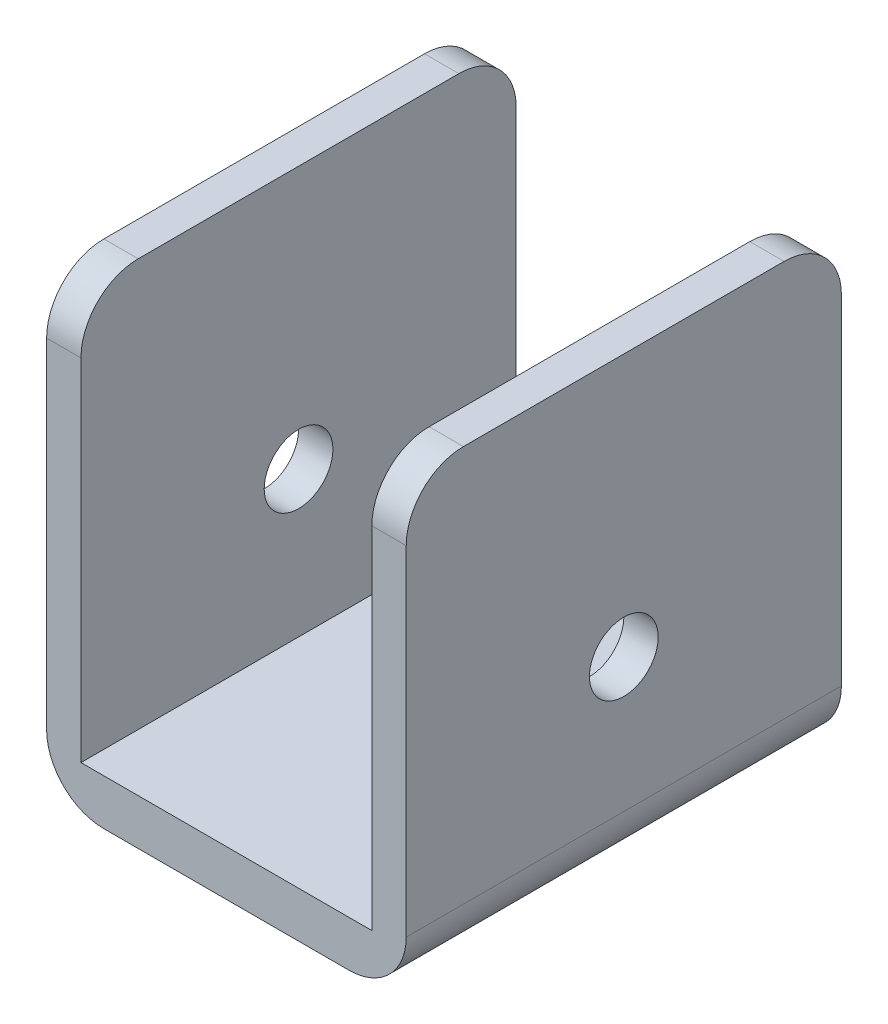
ISO-10303-21;
HEADER;
FILE_DESCRIPTION(('STEP AP214'),'2;1');
FILE_NAME('part.step','',(''),(''),'','','');
FILE_SCHEMA(('AUTOMOTIVE_DESIGN { 1 0 10303 214 1 1 1 1 }'));
ENDSEC;
DATA;
#1=APPLICATION_CONTEXT('core data for automotive mechanical design processes');
#2=APPLICATION_PROTOCOL_DEFINITION('international standard','automotive_design',2000,#1);
#3=PRODUCT_CONTEXT('',#1,'mechanical');
#4=PRODUCT('Part','Part','',(#3));
#5=PRODUCT_RELATED_PRODUCT_CATEGORY('part','',(#4));
#6=PRODUCT_DEFINITION_FORMATION('','',#4);
#7=PRODUCT_DEFINITION_CONTEXT('part definition',#1,'design');
#8=PRODUCT_DEFINITION('design','',#6,#7);
#9=PRODUCT_DEFINITION_SHAPE('','',#8);
#10=(LENGTH_UNIT() NAMED_UNIT(*) SI_UNIT(.MILLI.,.METRE.));
#11=(NAMED_UNIT(*) PLANE_ANGLE_UNIT() SI_UNIT($,.RADIAN.));
#12=(NAMED_UNIT(*) SI_UNIT($,.STERADIAN.) SOLID_ANGLE_UNIT());
#13=UNCERTAINTY_MEASURE_WITH_UNIT(LENGTH_MEASURE(1.E-05),#10,'distance_accuracy_value','');
#14=(GEOMETRIC_REPRESENTATION_CONTEXT(3) GLOBAL_UNCERTAINTY_ASSIGNED_CONTEXT((#13)) GLOBAL_UNIT_ASSIGNED_CONTEXT((#10,
#11,#12)) REPRESENTATION_CONTEXT('',''));
#15=CARTESIAN_POINT('',(0.,0.,0.));
#16=DIRECTION('',(0.,0.,1.));
#17=DIRECTION('',(1.,0.,0.));
#18=AXIS2_PLACEMENT_3D('',#15,#16,#17);
#19=CARTESIAN_POINT('',(-15.7,39.6,19.));
#20=DIRECTION('',(1.,0.,0.));
#21=DIRECTION('',(0.,1.,0.));
#22=AXIS2_PLACEMENT_3D('',#19,#20,#21);
#23=PLANE('',#22);
#24=CARTESIAN_POINT('',(-15.7,16.7,0.));
#25=DIRECTION('',(1.,0.,0.));
#26=DIRECTION('',(0.,1.,0.));
#27=AXIS2_PLACEMENT_3D('',#24,#25,#26);
#28=CIRCLE('',#27,3.);
#29=CARTESIAN_POINT('',(-15.7,19.7,0.));
#30=VERTEX_POINT('',#29);
#31=EDGE_CURVE('E203',#30,#30,#28,.T.);
#32=ORIENTED_EDGE('',*,*,#31,.T.);
#33=EDGE_LOOP('',(#32));
#34=FACE_BOUND('',#33,.T.);
#35=DIRECTION('',(0.,-1.,0.));
#36=VECTOR('',#35,1.);
#37=CARTESIAN_POINT('',(-15.7,39.6,-19.));
#38=LINE('',#37,#36);
#39=CARTESIAN_POINT('',(-15.7,34.6,-19.));
#40=VERTEX_POINT('',#39);
#41=CARTESIAN_POINT('',(-15.7,5.00000000000001,-19.));
#42=VERTEX_POINT('',#41);
#43=EDGE_CURVE('E172',#40,#42,#38,.T.);
#44=ORIENTED_EDGE('',*,*,#43,.T.);
#45=DIRECTION('',(0.,0.,-1.));
#46=VECTOR('',#45,1.);
#47=CARTESIAN_POINT('',(-15.7,5.,19.));
#48=LINE('',#47,#46);
#49=CARTESIAN_POINT('',(-15.7,5.00000000000001,19.));
#50=VERTEX_POINT('',#49);
#51=EDGE_CURVE('E220',#42,#50,#48,.F.);
#52=ORIENTED_EDGE('',*,*,#51,.T.);
#53=DIRECTION('',(0.,-1.,0.));
#54=VECTOR('',#53,1.);
#55=CARTESIAN_POINT('',(-15.7,39.6,19.));
#56=LINE('',#55,#54);
#57=CARTESIAN_POINT('',(-15.7,34.6,19.));
#58=VERTEX_POINT('',#57);
#59=EDGE_CURVE('E188',#58,#50,#56,.T.);
#60=ORIENTED_EDGE('',*,*,#59,.F.);
#61=CARTESIAN_POINT('',(-15.7,34.6,14.));
#62=DIRECTION('',(1.,0.,0.));
#63=DIRECTION('',(0.,1.,0.));
#64=AXIS2_PLACEMENT_3D('',#61,#62,#63);
#65=CIRCLE('',#64,5.);
#66=CARTESIAN_POINT('',(-15.7,39.6,14.));
#67=VERTEX_POINT('',#66);
#68=EDGE_CURVE('E218',#58,#67,#65,.F.);
#69=ORIENTED_EDGE('',*,*,#68,.T.);
#70=DIRECTION('',(0.,0.,-1.));
#71=VECTOR('',#70,1.);
#72=CARTESIAN_POINT('',(-15.7,39.6,19.));
#73=LINE('',#72,#71);
#74=CARTESIAN_POINT('',(-15.7,39.6,-14.));
#75=VERTEX_POINT('',#74);
#76=EDGE_CURVE('E168',#67,#75,#73,.T.);
#77=ORIENTED_EDGE('',*,*,#76,.T.);
#78=CARTESIAN_POINT('',(-15.7,34.6,-14.));
#79=DIRECTION('',(1.,0.,0.));
#80=DIRECTION('',(0.,1.,0.));
#81=AXIS2_PLACEMENT_3D('',#78,#79,#80);
#82=CIRCLE('',#81,5.);
#83=EDGE_CURVE('E216',#75,#40,#82,.F.);
#84=ORIENTED_EDGE('',*,*,#83,.T.);
#85=EDGE_LOOP('',(#44,#52,#60,#69,#77,#84));
#86=FACE_BOUND('',#85,.T.);
#87=ADVANCED_FACE('F41',(#34,#86),#23,.F.);
#88=CARTESIAN_POINT('',(-15.7,0.,19.));
#89=DIRECTION('',(0.,1.,0.));
#90=DIRECTION('',(-1.,0.,0.));
#91=AXIS2_PLACEMENT_3D('',#88,#89,#90);
#92=PLANE('',#91);
#93=DIRECTION('',(1.,0.,0.));
#94=VECTOR('',#93,1.);
#95=CARTESIAN_POINT('',(-15.7,0.,19.));
#96=LINE('',#95,#94);
#97=CARTESIAN_POINT('',(-10.7,0.,19.));
#98=VERTEX_POINT('',#97);
#99=CARTESIAN_POINT('',(10.7,0.,19.));
#100=VERTEX_POINT('',#99);
#101=EDGE_CURVE('E274',#98,#100,#96,.T.);
#102=ORIENTED_EDGE('',*,*,#101,.F.);
#103=DIRECTION('',(0.,0.,-1.));
#104=VECTOR('',#103,1.);
#105=CARTESIAN_POINT('',(-10.7,0.,19.));
#106=LINE('',#105,#104);
#107=CARTESIAN_POINT('',(-10.7,0.,-19.));
#108=VERTEX_POINT('',#107);
#109=EDGE_CURVE('E205',#98,#108,#106,.T.);
#110=ORIENTED_EDGE('',*,*,#109,.T.);
#111=DIRECTION('',(1.,0.,0.));
#112=VECTOR('',#111,1.);
#113=CARTESIAN_POINT('',(-15.7,0.,-19.));
#114=LINE('',#113,#112);
#115=CARTESIAN_POINT('',(10.7,0.,-19.));
#116=VERTEX_POINT('',#115);
#117=EDGE_CURVE('E175',#108,#116,#114,.T.);
#118=ORIENTED_EDGE('',*,*,#117,.T.);
#119=DIRECTION('',(0.,0.,-1.));
#120=VECTOR('',#119,1.);
#121=CARTESIAN_POINT('',(10.7,0.,19.));
#122=LINE('',#121,#120);
#123=EDGE_CURVE('E199',#116,#100,#122,.F.);
#124=ORIENTED_EDGE('',*,*,#123,.T.);
#125=EDGE_LOOP('',(#102,#110,#118,#124));
#126=FACE_BOUND('',#125,.T.);
#127=ADVANCED_FACE('F269',(#126),#92,.F.);
#128=CARTESIAN_POINT('',(15.7,39.6,19.));
#129=DIRECTION('',(-1.,0.,0.));
#130=DIRECTION('',(0.,0.,1.));
#131=AXIS2_PLACEMENT_3D('',#128,#129,#130);
#132=PLANE('',#131);
#133=CARTESIAN_POINT('',(15.7,16.7,0.));
#134=DIRECTION('',(1.,0.,0.));
#135=DIRECTION('',(0.,1.,0.));
#136=AXIS2_PLACEMENT_3D('',#133,#134,#135);
#137=CIRCLE('',#136,3.);
#138=CARTESIAN_POINT('',(15.7,19.7,0.));
#139=VERTEX_POINT('',#138);
#140=EDGE_CURVE('E280',#139,#139,#137,.T.);
#141=ORIENTED_EDGE('',*,*,#140,.F.);
#142=EDGE_LOOP('',(#141));
#143=FACE_BOUND('',#142,.T.);
#144=DIRECTION('',(0.,1.,0.));
#145=VECTOR('',#144,1.);
#146=CARTESIAN_POINT('',(15.7,39.6,19.));
#147=LINE('',#146,#145);
#148=CARTESIAN_POINT('',(15.7,5.00000000000001,19.));
#149=VERTEX_POINT('',#148);
#150=CARTESIAN_POINT('',(15.7,34.6,19.));
#151=VERTEX_POINT('',#150);
#152=EDGE_CURVE('E151',#149,#151,#147,.T.);
#153=ORIENTED_EDGE('',*,*,#152,.F.);
#154=DIRECTION('',(0.,0.,-1.));
#155=VECTOR('',#154,1.);
#156=CARTESIAN_POINT('',(15.7,5.,19.));
#157=LINE('',#156,#155);
#158=CARTESIAN_POINT('',(15.7,5.00000000000001,-19.));
#159=VERTEX_POINT('',#158);
#160=EDGE_CURVE('E234',#149,#159,#157,.T.);
#161=ORIENTED_EDGE('',*,*,#160,.T.);
#162=DIRECTION('',(0.,1.,0.));
#163=VECTOR('',#162,1.);
#164=CARTESIAN_POINT('',(15.7,39.6,-19.));
#165=LINE('',#164,#163);
#166=CARTESIAN_POINT('',(15.7,34.6,-19.));
#167=VERTEX_POINT('',#166);
#168=EDGE_CURVE('E179',#159,#167,#165,.T.);
#169=ORIENTED_EDGE('',*,*,#168,.T.);
#170=CARTESIAN_POINT('',(15.7,34.6,-14.));
#171=DIRECTION('',(-1.,0.,0.));
#172=DIRECTION('',(0.,0.,1.));
#173=AXIS2_PLACEMENT_3D('',#170,#171,#172);
#174=CIRCLE('',#173,5.);
#175=CARTESIAN_POINT('',(15.7,39.6,-14.));
#176=VERTEX_POINT('',#175);
#177=EDGE_CURVE('E232',#167,#176,#174,.F.);
#178=ORIENTED_EDGE('',*,*,#177,.T.);
#179=DIRECTION('',(0.,0.,-1.));
#180=VECTOR('',#179,1.);
#181=CARTESIAN_POINT('',(15.7,39.6,19.));
#182=LINE('',#181,#180);
#183=CARTESIAN_POINT('',(15.7,39.6,14.));
#184=VERTEX_POINT('',#183);
#185=EDGE_CURVE('E196',#184,#176,#182,.T.);
#186=ORIENTED_EDGE('',*,*,#185,.F.);
#187=CARTESIAN_POINT('',(15.7,34.6,14.));
#188=DIRECTION('',(-1.,0.,0.));
#189=DIRECTION('',(0.,0.,1.));
#190=AXIS2_PLACEMENT_3D('',#187,#188,#189);
#191=CIRCLE('',#190,5.);
#192=EDGE_CURVE('E230',#184,#151,#191,.F.);
#193=ORIENTED_EDGE('',*,*,#192,.T.);
#194=EDGE_LOOP('',(#153,#161,#169,#178,#186,#193));
#195=FACE_BOUND('',#194,.T.);
#196=ADVANCED_FACE('F262',(#143,#195),#132,.F.);
#197=CARTESIAN_POINT('',(15.7,39.6,19.));
#198=DIRECTION('',(0.,-1.,0.));
#199=DIRECTION('',(1.,0.,0.));
#200=AXIS2_PLACEMENT_3D('',#197,#198,#199);
#201=PLANE('',#200);
#202=ORIENTED_EDGE('',*,*,#185,.T.);
#203=DIRECTION('',(-1.,0.,0.));
#204=VECTOR('',#203,1.);
#205=CARTESIAN_POINT('',(15.7,39.6,-14.));
#206=LINE('',#205,#204);
#207=CARTESIAN_POINT('',(12.7,39.6,-14.));
#208=VERTEX_POINT('',#207);
#209=EDGE_CURVE('E248',#176,#208,#206,.T.);
#210=ORIENTED_EDGE('',*,*,#209,.T.);
#211=DIRECTION('',(0.,0.,-1.));
#212=VECTOR('',#211,1.);
#213=CARTESIAN_POINT('',(12.7,39.6,19.));
#214=LINE('',#213,#212);
#215=CARTESIAN_POINT('',(12.7,39.6,14.));
#216=VERTEX_POINT('',#215);
#217=EDGE_CURVE('E160',#216,#208,#214,.T.);
#218=ORIENTED_EDGE('',*,*,#217,.F.);
#219=DIRECTION('',(-1.,0.,0.));
#220=VECTOR('',#219,1.);
#221=CARTESIAN_POINT('',(15.7,39.6,14.));
#222=LINE('',#221,#220);
#223=EDGE_CURVE('E246',#216,#184,#222,.F.);
#224=ORIENTED_EDGE('',*,*,#223,.T.);
#225=EDGE_LOOP('',(#202,#210,#218,#224));
#226=FACE_BOUND('',#225,.T.);
#227=ADVANCED_FACE('F250',(#226),#201,.F.);
#228=CARTESIAN_POINT('',(12.7,39.6,19.));
#229=DIRECTION('',(1.,0.,0.));
#230=DIRECTION('',(0.,1.,0.));
#231=AXIS2_PLACEMENT_3D('',#228,#229,#230);
#232=PLANE('',#231);
#233=CARTESIAN_POINT('',(12.7,16.7,0.));
#234=DIRECTION('',(1.,0.,0.));
#235=DIRECTION('',(0.,1.,0.));
#236=AXIS2_PLACEMENT_3D('',#233,#234,#235);
#237=CIRCLE('',#236,3.);
#238=CARTESIAN_POINT('',(12.7,19.7,0.));
#239=VERTEX_POINT('',#238);
#240=EDGE_CURVE('E176',#239,#239,#237,.T.);
#241=ORIENTED_EDGE('',*,*,#240,.T.);
#242=EDGE_LOOP('',(#241));
#243=FACE_BOUND('',#242,.T.);
#244=ORIENTED_EDGE('',*,*,#217,.T.);
#245=CARTESIAN_POINT('',(12.7,34.6,-14.));
#246=DIRECTION('',(1.,0.,0.));
#247=DIRECTION('',(0.,1.,0.));
#248=AXIS2_PLACEMENT_3D('',#245,#246,#247);
#249=CIRCLE('',#248,5.);
#250=CARTESIAN_POINT('',(12.7,34.6,-19.));
#251=VERTEX_POINT('',#250);
#252=EDGE_CURVE('E11',#208,#251,#249,.F.);
#253=ORIENTED_EDGE('',*,*,#252,.T.);
#254=DIRECTION('',(0.,-1.,0.));
#255=VECTOR('',#254,1.);
#256=CARTESIAN_POINT('',(12.7,39.6,-19.));
#257=LINE('',#256,#255);
#258=CARTESIAN_POINT('',(12.7,4.,-19.));
#259=VERTEX_POINT('',#258);
#260=EDGE_CURVE('E157',#251,#259,#257,.T.);
#261=ORIENTED_EDGE('',*,*,#260,.T.);
#262=DIRECTION('',(0.,0.,-1.));
#263=VECTOR('',#262,1.);
#264=CARTESIAN_POINT('',(12.7,4.,19.));
#265=LINE('',#264,#263);
#266=CARTESIAN_POINT('',(12.7,4.,19.));
#267=VERTEX_POINT('',#266);
#268=EDGE_CURVE('E154',#267,#259,#265,.T.);
#269=ORIENTED_EDGE('',*,*,#268,.F.);
#270=DIRECTION('',(0.,-1.,0.));
#271=VECTOR('',#270,1.);
#272=CARTESIAN_POINT('',(12.7,39.6,19.));
#273=LINE('',#272,#271);
#274=CARTESIAN_POINT('',(12.7,34.6,19.));
#275=VERTEX_POINT('',#274);
#276=EDGE_CURVE('E140',#275,#267,#273,.T.);
#277=ORIENTED_EDGE('',*,*,#276,.F.);
#278=CARTESIAN_POINT('',(12.7,34.6,14.));
#279=DIRECTION('',(1.,0.,0.));
#280=DIRECTION('',(0.,1.,0.));
#281=AXIS2_PLACEMENT_3D('',#278,#279,#280);
#282=CIRCLE('',#281,5.);
#283=EDGE_CURVE('E49',#275,#216,#282,.F.);
#284=ORIENTED_EDGE('',*,*,#283,.T.);
#285=EDGE_LOOP('',(#244,#253,#261,#269,#277,#284));
#286=FACE_BOUND('',#285,.T.);
#287=ADVANCED_FACE('F155',(#243,#286),#232,.F.);
#288=CARTESIAN_POINT('',(-12.7,4.,19.));
#289=DIRECTION('',(0.,-1.,0.));
#290=DIRECTION('',(1.,0.,0.));
#291=AXIS2_PLACEMENT_3D('',#288,#289,#290);
#292=PLANE('',#291);
#293=DIRECTION('',(-1.,0.,0.));
#294=VECTOR('',#293,1.);
#295=CARTESIAN_POINT('',(-12.7,4.,-19.));
#296=LINE('',#295,#294);
#297=CARTESIAN_POINT('',(-12.7,4.,-19.));
#298=VERTEX_POINT('',#297);
#299=EDGE_CURVE('E183',#259,#298,#296,.T.);
#300=ORIENTED_EDGE('',*,*,#299,.T.);
#301=DIRECTION('',(0.,0.,-1.));
#302=VECTOR('',#301,1.);
#303=CARTESIAN_POINT('',(-12.7,4.,19.));
#304=LINE('',#303,#302);
#305=CARTESIAN_POINT('',(-12.7,4.,19.));
#306=VERTEX_POINT('',#305);
#307=EDGE_CURVE('E161',#306,#298,#304,.T.);
#308=ORIENTED_EDGE('',*,*,#307,.F.);
#309=DIRECTION('',(-1.,0.,0.));
#310=VECTOR('',#309,1.);
#311=CARTESIAN_POINT('',(-12.7,4.,19.));
#312=LINE('',#311,#310);
#313=EDGE_CURVE('E146',#267,#306,#312,.T.);
#314=ORIENTED_EDGE('',*,*,#313,.F.);
#315=ORIENTED_EDGE('',*,*,#268,.T.);
#316=EDGE_LOOP('',(#300,#308,#314,#315));
#317=FACE_BOUND('',#316,.T.);
#318=ADVANCED_FACE('F163',(#317),#292,.F.);
#319=CARTESIAN_POINT('',(-12.7,39.6,19.));
#320=DIRECTION('',(-1.,0.,0.));
#321=DIRECTION('',(0.,-1.,0.));
#322=AXIS2_PLACEMENT_3D('',#319,#320,#321);
#323=PLANE('',#322);
#324=CARTESIAN_POINT('',(-12.7,16.7,0.));
#325=DIRECTION('',(-1.,0.,0.));
#326=DIRECTION('',(0.,-1.,0.));
#327=AXIS2_PLACEMENT_3D('',#324,#325,#326);
#328=CIRCLE('',#327,3.);
#329=CARTESIAN_POINT('',(-12.7,13.7,0.));
#330=VERTEX_POINT('',#329);
#331=EDGE_CURVE('E200',#330,#330,#328,.T.);
#332=ORIENTED_EDGE('',*,*,#331,.T.);
#333=EDGE_LOOP('',(#332));
#334=FACE_BOUND('',#333,.T.);
#335=DIRECTION('',(0.,0.,-1.));
#336=VECTOR('',#335,1.);
#337=CARTESIAN_POINT('',(-12.7,39.6,19.));
#338=LINE('',#337,#336);
#339=CARTESIAN_POINT('',(-12.7,39.6,14.));
#340=VERTEX_POINT('',#339);
#341=CARTESIAN_POINT('',(-12.7,39.6,-14.));
#342=VERTEX_POINT('',#341);
#343=EDGE_CURVE('E191',#340,#342,#338,.T.);
#344=ORIENTED_EDGE('',*,*,#343,.F.);
#345=CARTESIAN_POINT('',(-12.7,34.6,14.));
#346=DIRECTION('',(-1.,0.,0.));
#347=DIRECTION('',(0.,-1.,0.));
#348=AXIS2_PLACEMENT_3D('',#345,#346,#347);
#349=CIRCLE('',#348,5.);
#350=CARTESIAN_POINT('',(-12.7,34.6,19.));
#351=VERTEX_POINT('',#350);
#352=EDGE_CURVE('E244',#340,#351,#349,.F.);
#353=ORIENTED_EDGE('',*,*,#352,.T.);
#354=DIRECTION('',(0.,1.,0.));
#355=VECTOR('',#354,1.);
#356=CARTESIAN_POINT('',(-12.7,39.6,19.));
#357=LINE('',#356,#355);
#358=EDGE_CURVE('E166',#306,#351,#357,.T.);
#359=ORIENTED_EDGE('',*,*,#358,.F.);
#360=ORIENTED_EDGE('',*,*,#307,.T.);
#361=DIRECTION('',(0.,1.,0.));
#362=VECTOR('',#361,1.);
#363=CARTESIAN_POINT('',(-12.7,39.6,-19.));
#364=LINE('',#363,#362);
#365=CARTESIAN_POINT('',(-12.7,34.6,-19.));
#366=VERTEX_POINT('',#365);
#367=EDGE_CURVE('E185',#298,#366,#364,.T.);
#368=ORIENTED_EDGE('',*,*,#367,.T.);
#369=CARTESIAN_POINT('',(-12.7,34.6,-14.));
#370=DIRECTION('',(-1.,0.,0.));
#371=DIRECTION('',(0.,-1.,0.));
#372=AXIS2_PLACEMENT_3D('',#369,#370,#371);
#373=CIRCLE('',#372,5.);
#374=EDGE_CURVE('E242',#366,#342,#373,.F.);
#375=ORIENTED_EDGE('',*,*,#374,.T.);
#376=EDGE_LOOP('',(#344,#353,#359,#360,#368,#375));
#377=FACE_BOUND('',#376,.T.);
#378=ADVANCED_FACE('F295',(#334,#377),#323,.F.);
#379=CARTESIAN_POINT('',(-15.7,39.6,19.));
#380=DIRECTION('',(0.,-1.,0.));
#381=DIRECTION('',(0.,0.,-1.));
#382=AXIS2_PLACEMENT_3D('',#379,#380,#381);
#383=PLANE('',#382);
#384=ORIENTED_EDGE('',*,*,#76,.F.);
#385=DIRECTION('',(-1.,0.,0.));
#386=VECTOR('',#385,1.);
#387=CARTESIAN_POINT('',(-12.7,39.6,14.));
#388=LINE('',#387,#386);
#389=EDGE_CURVE('E240',#67,#340,#388,.F.);
#390=ORIENTED_EDGE('',*,*,#389,.T.);
#391=ORIENTED_EDGE('',*,*,#343,.T.);
#392=DIRECTION('',(-1.,0.,0.));
#393=VECTOR('',#392,1.);
#394=CARTESIAN_POINT('',(-15.7,39.6,-14.));
#395=LINE('',#394,#393);
#396=EDGE_CURVE('E237',#342,#75,#395,.T.);
#397=ORIENTED_EDGE('',*,*,#396,.T.);
#398=EDGE_LOOP('',(#384,#390,#391,#397));
#399=FACE_BOUND('',#398,.T.);
#400=ADVANCED_FACE('F298',(#399),#383,.F.);
#401=CARTESIAN_POINT('',(0.,0.,19.));
#402=DIRECTION('',(0.,0.,1.));
#403=DIRECTION('',(1.,0.,0.));
#404=AXIS2_PLACEMENT_3D('',#401,#402,#403);
#405=PLANE('',#404);
#406=ORIENTED_EDGE('',*,*,#59,.T.);
#407=CARTESIAN_POINT('',(-10.7,5.,19.));
#408=DIRECTION('',(0.,0.,1.));
#409=DIRECTION('',(1.,0.,0.));
#410=AXIS2_PLACEMENT_3D('',#407,#408,#409);
#411=CIRCLE('',#410,5.);
#412=EDGE_CURVE('E228',#50,#98,#411,.T.);
#413=ORIENTED_EDGE('',*,*,#412,.T.);
#414=ORIENTED_EDGE('',*,*,#101,.T.);
#415=CARTESIAN_POINT('',(10.7,5.,19.));
#416=DIRECTION('',(0.,0.,1.));
#417=DIRECTION('',(1.,0.,0.));
#418=AXIS2_PLACEMENT_3D('',#415,#416,#417);
#419=CIRCLE('',#418,5.);
#420=EDGE_CURVE('E226',#100,#149,#419,.T.);
#421=ORIENTED_EDGE('',*,*,#420,.T.);
#422=ORIENTED_EDGE('',*,*,#152,.T.);
#423=DIRECTION('',(-1.,0.,0.));
#424=VECTOR('',#423,1.);
#425=CARTESIAN_POINT('',(12.7,34.6,19.));
#426=LINE('',#425,#424);
#427=EDGE_CURVE('E150',#151,#275,#426,.T.);
#428=ORIENTED_EDGE('',*,*,#427,.T.);
#429=ORIENTED_EDGE('',*,*,#276,.T.);
#430=ORIENTED_EDGE('',*,*,#313,.T.);
#431=ORIENTED_EDGE('',*,*,#358,.T.);
#432=DIRECTION('',(-1.,0.,0.));
#433=VECTOR('',#432,1.);
#434=CARTESIAN_POINT('',(-15.7,34.6,19.));
#435=LINE('',#434,#433);
#436=EDGE_CURVE('E223',#351,#58,#435,.T.);
#437=ORIENTED_EDGE('',*,*,#436,.T.);
#438=EDGE_LOOP('',(#406,#413,#414,#421,#422,#428,#429,#430,#431,#437));
#439=FACE_BOUND('',#438,.T.);
#440=ADVANCED_FACE('F143',(#439),#405,.T.);
#441=CARTESIAN_POINT('',(0.,0.,-19.));
#442=DIRECTION('',(0.,0.,1.));
#443=DIRECTION('',(1.,0.,0.));
#444=AXIS2_PLACEMENT_3D('',#441,#442,#443);
#445=PLANE('',#444);
#446=ORIENTED_EDGE('',*,*,#117,.F.);
#447=CARTESIAN_POINT('',(-10.7,5.,-19.));
#448=DIRECTION('',(0.,0.,1.));
#449=DIRECTION('',(1.,0.,0.));
#450=AXIS2_PLACEMENT_3D('',#447,#448,#449);
#451=CIRCLE('',#450,5.);
#452=EDGE_CURVE('E214',#108,#42,#451,.F.);
#453=ORIENTED_EDGE('',*,*,#452,.T.);
#454=ORIENTED_EDGE('',*,*,#43,.F.);
#455=DIRECTION('',(-1.,0.,0.));
#456=VECTOR('',#455,1.);
#457=CARTESIAN_POINT('',(0.,34.6,-19.));
#458=LINE('',#457,#456);
#459=EDGE_CURVE('E210',#40,#366,#458,.F.);
#460=ORIENTED_EDGE('',*,*,#459,.T.);
#461=ORIENTED_EDGE('',*,*,#367,.F.);
#462=ORIENTED_EDGE('',*,*,#299,.F.);
#463=ORIENTED_EDGE('',*,*,#260,.F.);
#464=DIRECTION('',(-1.,0.,0.));
#465=VECTOR('',#464,1.);
#466=CARTESIAN_POINT('',(0.,34.6,-19.));
#467=LINE('',#466,#465);
#468=EDGE_CURVE('E208',#251,#167,#467,.F.);
#469=ORIENTED_EDGE('',*,*,#468,.T.);
#470=ORIENTED_EDGE('',*,*,#168,.F.);
#471=CARTESIAN_POINT('',(10.7,5.,-19.));
#472=DIRECTION('',(0.,0.,1.));
#473=DIRECTION('',(1.,0.,0.));
#474=AXIS2_PLACEMENT_3D('',#471,#472,#473);
#475=CIRCLE('',#474,5.);
#476=EDGE_CURVE('E212',#159,#116,#475,.F.);
#477=ORIENTED_EDGE('',*,*,#476,.T.);
#478=EDGE_LOOP('',(#446,#453,#454,#460,#461,#462,#463,#469,#470,#477));
#479=FACE_BOUND('',#478,.T.);
#480=ADVANCED_FACE('F256',(#479),#445,.F.);
#481=CARTESIAN_POINT('',(-15.7,16.7,0.));
#482=DIRECTION('',(1.,0.,0.));
#483=DIRECTION('',(0.,1.,0.));
#484=AXIS2_PLACEMENT_3D('',#481,#482,#483);
#485=CYLINDRICAL_SURFACE('',#484,3.);
#486=ORIENTED_EDGE('',*,*,#31,.F.);
#487=EDGE_LOOP('',(#486));
#488=FACE_BOUND('',#487,.T.);
#489=ORIENTED_EDGE('',*,*,#331,.F.);
#490=EDGE_LOOP('',(#489));
#491=FACE_BOUND('',#490,.T.);
#492=ADVANCED_FACE('F288',(#488,#491),#485,.F.);
#493=ORIENTED_EDGE('',*,*,#140,.T.);
#494=EDGE_LOOP('',(#493));
#495=FACE_BOUND('',#494,.T.);
#496=ORIENTED_EDGE('',*,*,#240,.F.);
#497=EDGE_LOOP('',(#496));
#498=FACE_BOUND('',#497,.T.);
#499=ADVANCED_FACE('F291',(#495,#498),#485,.F.);
#500=CARTESIAN_POINT('',(-10.7,5.,19.));
#501=DIRECTION('',(0.,0.,-1.));
#502=DIRECTION('',(-1.,0.,0.));
#503=AXIS2_PLACEMENT_3D('',#500,#501,#502);
#504=CYLINDRICAL_SURFACE('',#503,5.);
#505=ORIENTED_EDGE('',*,*,#412,.F.);
#506=ORIENTED_EDGE('',*,*,#51,.F.);
#507=ORIENTED_EDGE('',*,*,#452,.F.);
#508=ORIENTED_EDGE('',*,*,#109,.F.);
#509=EDGE_LOOP('',(#505,#506,#507,#508));
#510=FACE_BOUND('',#509,.T.);
#511=ADVANCED_FACE('F315',(#510),#504,.T.);
#512=CARTESIAN_POINT('',(10.7,5.,19.));
#513=DIRECTION('',(0.,0.,-1.));
#514=DIRECTION('',(-1.,0.,0.));
#515=AXIS2_PLACEMENT_3D('',#512,#513,#514);
#516=CYLINDRICAL_SURFACE('',#515,5.);
#517=ORIENTED_EDGE('',*,*,#420,.F.);
#518=ORIENTED_EDGE('',*,*,#123,.F.);
#519=ORIENTED_EDGE('',*,*,#476,.F.);
#520=ORIENTED_EDGE('',*,*,#160,.F.);
#521=EDGE_LOOP('',(#517,#518,#519,#520));
#522=FACE_BOUND('',#521,.T.);
#523=ADVANCED_FACE('F273',(#522),#516,.T.);
#524=CARTESIAN_POINT('',(0.,34.6,14.));
#525=DIRECTION('',(1.,0.,0.));
#526=DIRECTION('',(0.,0.,-1.));
#527=AXIS2_PLACEMENT_3D('',#524,#525,#526);
#528=CYLINDRICAL_SURFACE('',#527,5.);
#529=ORIENTED_EDGE('',*,*,#352,.F.);
#530=ORIENTED_EDGE('',*,*,#389,.F.);
#531=ORIENTED_EDGE('',*,*,#68,.F.);
#532=ORIENTED_EDGE('',*,*,#436,.F.);
#533=EDGE_LOOP('',(#529,#530,#531,#532));
#534=FACE_BOUND('',#533,.T.);
#535=ADVANCED_FACE('F308',(#534),#528,.T.);
#536=CARTESIAN_POINT('',(-15.7,34.6,-14.));
#537=DIRECTION('',(-1.,0.,0.));
#538=DIRECTION('',(0.,0.,1.));
#539=AXIS2_PLACEMENT_3D('',#536,#537,#538);
#540=CYLINDRICAL_SURFACE('',#539,5.);
#541=ORIENTED_EDGE('',*,*,#374,.F.);
#542=ORIENTED_EDGE('',*,*,#459,.F.);
#543=ORIENTED_EDGE('',*,*,#83,.F.);
#544=ORIENTED_EDGE('',*,*,#396,.F.);
#545=EDGE_LOOP('',(#541,#542,#543,#544));
#546=FACE_BOUND('',#545,.T.);
#547=ADVANCED_FACE('F318',(#546),#540,.T.);
#548=CARTESIAN_POINT('',(15.7,34.6,-14.));
#549=DIRECTION('',(-1.,0.,0.));
#550=DIRECTION('',(0.,-1.,0.));
#551=AXIS2_PLACEMENT_3D('',#548,#549,#550);
#552=CYLINDRICAL_SURFACE('',#551,5.);
#553=ORIENTED_EDGE('',*,*,#177,.F.);
#554=ORIENTED_EDGE('',*,*,#468,.F.);
#555=ORIENTED_EDGE('',*,*,#252,.F.);
#556=ORIENTED_EDGE('',*,*,#209,.F.);
#557=EDGE_LOOP('',(#553,#554,#555,#556));
#558=FACE_BOUND('',#557,.T.);
#559=ADVANCED_FACE('F259',(#558),#552,.T.);
#560=CARTESIAN_POINT('',(0.,34.6,14.));
#561=DIRECTION('',(1.,0.,0.));
#562=DIRECTION('',(0.,1.,0.));
#563=AXIS2_PLACEMENT_3D('',#560,#561,#562);
#564=CYLINDRICAL_SURFACE('',#563,5.);
#565=ORIENTED_EDGE('',*,*,#192,.F.);
#566=ORIENTED_EDGE('',*,*,#223,.F.);
#567=ORIENTED_EDGE('',*,*,#283,.F.);
#568=ORIENTED_EDGE('',*,*,#427,.F.);
#569=EDGE_LOOP('',(#565,#566,#567,#568));
#570=FACE_BOUND('',#569,.T.);
#571=ADVANCED_FACE('F43',(#570),#564,.T.);
#572=CLOSED_SHELL('',(#87,#127,#196,#227,#287,#318,#378,#400,#440,#480,#492,#499,#511,#523,#535,
#547,#559,#571));
#573=MANIFOLD_SOLID_BREP('B2',#572);
#574=ADVANCED_BREP_SHAPE_REPRESENTATION('',(#18,#573),#14);
#575=SHAPE_DEFINITION_REPRESENTATION(#9,#574);
ENDSEC;
END-ISO-10303-21;
